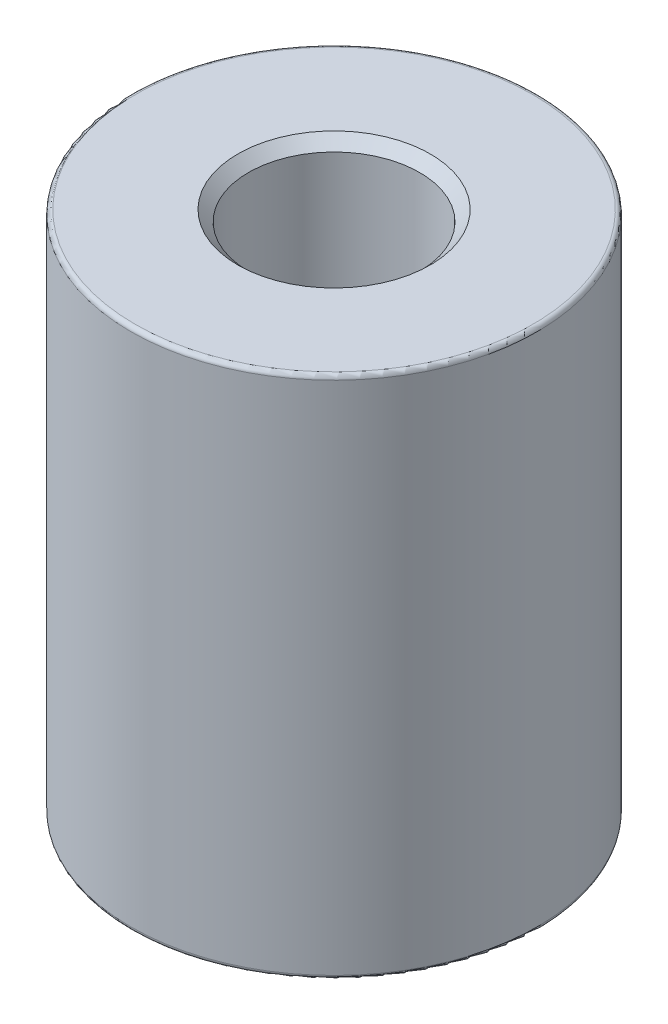
ISO-10303-21;
HEADER;
FILE_DESCRIPTION(('STEP AP214'),'2;1');
FILE_NAME('part.step','',(''),(''),'','','');
FILE_SCHEMA(('AUTOMOTIVE_DESIGN { 1 0 10303 214 1 1 1 1 }'));
ENDSEC;
DATA;
#1=APPLICATION_CONTEXT('core data for automotive mechanical design processes');
#2=APPLICATION_PROTOCOL_DEFINITION('international standard','automotive_design',2000,#1);
#3=PRODUCT_CONTEXT('',#1,'mechanical');
#4=PRODUCT('Part','Part','',(#3));
#5=PRODUCT_RELATED_PRODUCT_CATEGORY('part','',(#4));
#6=PRODUCT_DEFINITION_FORMATION('','',#4);
#7=PRODUCT_DEFINITION_CONTEXT('part definition',#1,'design');
#8=PRODUCT_DEFINITION('design','',#6,#7);
#9=PRODUCT_DEFINITION_SHAPE('','',#8);
#10=(LENGTH_UNIT() NAMED_UNIT(*) SI_UNIT(.MILLI.,.METRE.));
#11=(NAMED_UNIT(*) PLANE_ANGLE_UNIT() SI_UNIT($,.RADIAN.));
#12=(NAMED_UNIT(*) SI_UNIT($,.STERADIAN.) SOLID_ANGLE_UNIT());
#13=UNCERTAINTY_MEASURE_WITH_UNIT(LENGTH_MEASURE(1.E-05),#10,'distance_accuracy_value','');
#14=(GEOMETRIC_REPRESENTATION_CONTEXT(3) GLOBAL_UNCERTAINTY_ASSIGNED_CONTEXT((#13)) GLOBAL_UNIT_ASSIGNED_CONTEXT((#10,
#11,#12)) REPRESENTATION_CONTEXT('',''));
#15=CARTESIAN_POINT('',(0.,0.,0.));
#16=DIRECTION('',(0.,0.,1.));
#17=DIRECTION('',(1.,0.,0.));
#18=AXIS2_PLACEMENT_3D('',#15,#16,#17);
#19=CARTESIAN_POINT('',(0.,24.5,0.));
#20=DIRECTION('',(0.,-1.,0.));
#21=DIRECTION('',(0.,0.,-1.));
#22=AXIS2_PLACEMENT_3D('',#19,#20,#21);
#23=CYLINDRICAL_SURFACE('',#22,9.5);
#24=CARTESIAN_POINT('',(0.,24.3,0.));
#25=DIRECTION('',(0.,1.,0.));
#26=DIRECTION('',(0.,0.,1.));
#27=AXIS2_PLACEMENT_3D('',#24,#25,#26);
#28=CIRCLE('',#27,9.5);
#29=CARTESIAN_POINT('',(0.,24.3,9.5));
#30=VERTEX_POINT('',#29);
#31=EDGE_CURVE('E45',#30,#30,#28,.F.);
#32=ORIENTED_EDGE('',*,*,#31,.T.);
#33=EDGE_LOOP('',(#32));
#34=FACE_BOUND('',#33,.T.);
#35=CARTESIAN_POINT('',(0.,0.199999999999999,0.));
#36=DIRECTION('',(0.,1.,0.));
#37=DIRECTION('',(0.,0.,1.));
#38=AXIS2_PLACEMENT_3D('',#35,#36,#37);
#39=CIRCLE('',#38,9.5);
#40=CARTESIAN_POINT('',(0.,0.199999999999999,9.5));
#41=VERTEX_POINT('',#40);
#42=EDGE_CURVE('E50',#41,#41,#39,.T.);
#43=ORIENTED_EDGE('',*,*,#42,.T.);
#44=EDGE_LOOP('',(#43));
#45=FACE_BOUND('',#44,.T.);
#46=ADVANCED_FACE('F37',(#34,#45),#23,.T.);
#47=CARTESIAN_POINT('',(0.,24.5,0.));
#48=DIRECTION('',(0.,1.,0.));
#49=DIRECTION('',(0.,0.,1.));
#50=AXIS2_PLACEMENT_3D('',#47,#48,#49);
#51=PLANE('',#50);
#52=CARTESIAN_POINT('',(0.,24.5,0.));
#53=DIRECTION('',(0.,1.,0.));
#54=DIRECTION('',(0.,0.,1.));
#55=AXIS2_PLACEMENT_3D('',#52,#53,#54);
#56=CIRCLE('',#55,9.3);
#57=CARTESIAN_POINT('',(0.,24.5,9.3));
#58=VERTEX_POINT('',#57);
#59=EDGE_CURVE('E55',#58,#58,#56,.T.);
#60=ORIENTED_EDGE('',*,*,#59,.T.);
#61=EDGE_LOOP('',(#60));
#62=FACE_BOUND('',#61,.T.);
#63=CARTESIAN_POINT('',(0.,24.5,0.));
#64=DIRECTION('',(0.,1.,0.));
#65=DIRECTION('',(0.,0.,1.));
#66=AXIS2_PLACEMENT_3D('',#63,#64,#65);
#67=CIRCLE('',#66,4.50000000000001);
#68=CARTESIAN_POINT('',(0.,24.5,4.50000000000001));
#69=VERTEX_POINT('',#68);
#70=EDGE_CURVE('E69',#69,#69,#67,.F.);
#71=ORIENTED_EDGE('',*,*,#70,.T.);
#72=EDGE_LOOP('',(#71));
#73=FACE_BOUND('',#72,.T.);
#74=ADVANCED_FACE('F100',(#62,#73),#51,.T.);
#75=CARTESIAN_POINT('',(0.,0.,0.));
#76=DIRECTION('',(0.,1.,0.));
#77=DIRECTION('',(0.,0.,1.));
#78=AXIS2_PLACEMENT_3D('',#75,#76,#77);
#79=PLANE('',#78);
#80=CARTESIAN_POINT('',(0.,0.,0.));
#81=DIRECTION('',(0.,1.,0.));
#82=DIRECTION('',(0.,0.,1.));
#83=AXIS2_PLACEMENT_3D('',#80,#81,#82);
#84=CIRCLE('',#83,9.3);
#85=CARTESIAN_POINT('',(0.,0.,9.3));
#86=VERTEX_POINT('',#85);
#87=EDGE_CURVE('E10',#86,#86,#84,.F.);
#88=ORIENTED_EDGE('',*,*,#87,.T.);
#89=EDGE_LOOP('',(#88));
#90=FACE_BOUND('',#89,.T.);
#91=CARTESIAN_POINT('',(0.,0.,0.));
#92=DIRECTION('',(0.,1.,0.));
#93=DIRECTION('',(0.,0.,1.));
#94=AXIS2_PLACEMENT_3D('',#91,#92,#93);
#95=CIRCLE('',#94,3.5);
#96=CARTESIAN_POINT('',(0.,0.,3.5));
#97=VERTEX_POINT('',#96);
#98=EDGE_CURVE('E61',#97,#97,#95,.T.);
#99=ORIENTED_EDGE('',*,*,#98,.T.);
#100=EDGE_LOOP('',(#99));
#101=FACE_BOUND('',#100,.T.);
#102=ADVANCED_FACE('F90',(#90,#101),#79,.F.);
#103=CARTESIAN_POINT('',(0.,8.5,0.));
#104=DIRECTION('',(0.,1.,0.));
#105=DIRECTION('',(0.,0.,1.));
#106=AXIS2_PLACEMENT_3D('',#103,#104,#105);
#107=CYLINDRICAL_SURFACE('',#106,4.);
#108=CARTESIAN_POINT('',(0.,24.,0.));
#109=DIRECTION('',(0.,1.,0.));
#110=DIRECTION('',(0.,0.,1.));
#111=AXIS2_PLACEMENT_3D('',#108,#109,#110);
#112=CIRCLE('',#111,4.);
#113=CARTESIAN_POINT('',(0.,24.,4.));
#114=VERTEX_POINT('',#113);
#115=EDGE_CURVE('E73',#114,#114,#112,.T.);
#116=ORIENTED_EDGE('',*,*,#115,.T.);
#117=EDGE_LOOP('',(#116));
#118=FACE_BOUND('',#117,.T.);
#119=CARTESIAN_POINT('',(0.,8.5,0.));
#120=DIRECTION('',(0.,1.,0.));
#121=DIRECTION('',(0.,0.,1.));
#122=AXIS2_PLACEMENT_3D('',#119,#120,#121);
#123=CIRCLE('',#122,4.);
#124=CARTESIAN_POINT('',(0.,8.5,4.));
#125=VERTEX_POINT('',#124);
#126=EDGE_CURVE('E77',#125,#125,#123,.T.);
#127=ORIENTED_EDGE('',*,*,#126,.F.);
#128=EDGE_LOOP('',(#127));
#129=FACE_BOUND('',#128,.T.);
#130=ADVANCED_FACE('F88',(#118,#129),#107,.F.);
#131=CARTESIAN_POINT('',(0.,8.5,0.));
#132=DIRECTION('',(0.,1.,0.));
#133=DIRECTION('',(0.,0.,1.));
#134=AXIS2_PLACEMENT_3D('',#131,#132,#133);
#135=PLANE('',#134);
#136=CARTESIAN_POINT('',(0.,8.5,0.));
#137=DIRECTION('',(0.,1.,0.));
#138=DIRECTION('',(0.,0.,1.));
#139=AXIS2_PLACEMENT_3D('',#136,#137,#138);
#140=CIRCLE('',#139,3.);
#141=CARTESIAN_POINT('',(0.,8.5,3.));
#142=VERTEX_POINT('',#141);
#143=EDGE_CURVE('E78',#142,#142,#140,.T.);
#144=ORIENTED_EDGE('',*,*,#143,.F.);
#145=EDGE_LOOP('',(#144));
#146=FACE_BOUND('',#145,.T.);
#147=ORIENTED_EDGE('',*,*,#126,.T.);
#148=EDGE_LOOP('',(#147));
#149=FACE_BOUND('',#148,.T.);
#150=ADVANCED_FACE('F86',(#146,#149),#135,.T.);
#151=CARTESIAN_POINT('',(0.,16.,0.));
#152=DIRECTION('',(0.,-1.,0.));
#153=DIRECTION('',(0.,0.,-1.));
#154=AXIS2_PLACEMENT_3D('',#151,#152,#153);
#155=CYLINDRICAL_SURFACE('',#154,3.);
#156=CARTESIAN_POINT('',(0.,0.499999999999997,0.));
#157=DIRECTION('',(0.,1.,0.));
#158=DIRECTION('',(0.,0.,1.));
#159=AXIS2_PLACEMENT_3D('',#156,#157,#158);
#160=CIRCLE('',#159,3.);
#161=CARTESIAN_POINT('',(0.,0.499999999999997,3.));
#162=VERTEX_POINT('',#161);
#163=EDGE_CURVE('E65',#162,#162,#160,.F.);
#164=ORIENTED_EDGE('',*,*,#163,.T.);
#165=EDGE_LOOP('',(#164));
#166=FACE_BOUND('',#165,.T.);
#167=ORIENTED_EDGE('',*,*,#143,.T.);
#168=EDGE_LOOP('',(#167));
#169=FACE_BOUND('',#168,.T.);
#170=ADVANCED_FACE('F97',(#166,#169),#155,.F.);
#171=CARTESIAN_POINT('',(0.,24.,0.));
#172=DIRECTION('',(0.,1.,0.));
#173=DIRECTION('',(0.,0.,1.));
#174=AXIS2_PLACEMENT_3D('',#171,#172,#173);
#175=CONICAL_SURFACE('',#174,4.,0.785398163397459);
#176=ORIENTED_EDGE('',*,*,#70,.F.);
#177=EDGE_LOOP('',(#176));
#178=FACE_BOUND('',#177,.T.);
#179=ORIENTED_EDGE('',*,*,#115,.F.);
#180=EDGE_LOOP('',(#179));
#181=FACE_BOUND('',#180,.T.);
#182=ADVANCED_FACE('F111',(#178,#181),#175,.F.);
#183=CARTESIAN_POINT('',(0.,0.499999999999997,0.));
#184=DIRECTION('',(0.,-1.,0.));
#185=DIRECTION('',(0.,0.,-1.));
#186=AXIS2_PLACEMENT_3D('',#183,#184,#185);
#187=CONICAL_SURFACE('',#186,3.,0.785398163397451);
#188=ORIENTED_EDGE('',*,*,#98,.F.);
#189=EDGE_LOOP('',(#188));
#190=FACE_BOUND('',#189,.T.);
#191=ORIENTED_EDGE('',*,*,#163,.F.);
#192=EDGE_LOOP('',(#191));
#193=FACE_BOUND('',#192,.T.);
#194=ADVANCED_FACE('F114',(#190,#193),#187,.F.);
#195=CARTESIAN_POINT('',(0.,24.3,0.));
#196=DIRECTION('',(0.,1.,0.));
#197=DIRECTION('',(0.,0.,1.));
#198=AXIS2_PLACEMENT_3D('',#195,#196,#197);
#199=TOROIDAL_SURFACE('',#198,9.3,0.2);
#200=ORIENTED_EDGE('',*,*,#31,.F.);
#201=EDGE_LOOP('',(#200));
#202=FACE_BOUND('',#201,.T.);
#203=ORIENTED_EDGE('',*,*,#59,.F.);
#204=EDGE_LOOP('',(#203));
#205=FACE_BOUND('',#204,.T.);
#206=ADVANCED_FACE('F117',(#202,#205),#199,.T.);
#207=CARTESIAN_POINT('',(0.,0.199999999999999,0.));
#208=DIRECTION('',(0.,1.,0.));
#209=DIRECTION('',(0.,0.,1.));
#210=AXIS2_PLACEMENT_3D('',#207,#208,#209);
#211=TOROIDAL_SURFACE('',#210,9.3,0.2);
#212=ORIENTED_EDGE('',*,*,#87,.F.);
#213=EDGE_LOOP('',(#212));
#214=FACE_BOUND('',#213,.T.);
#215=ORIENTED_EDGE('',*,*,#42,.F.);
#216=EDGE_LOOP('',(#215));
#217=FACE_BOUND('',#216,.T.);
#218=ADVANCED_FACE('F39',(#214,#217),#211,.T.);
#219=CLOSED_SHELL('',(#46,#74,#102,#130,#150,#170,#182,#194,#206,#218));
#220=MANIFOLD_SOLID_BREP('B2',#219);
#221=ADVANCED_BREP_SHAPE_REPRESENTATION('',(#18,#220),#14);
#222=SHAPE_DEFINITION_REPRESENTATION(#9,#221);
ENDSEC;
END-ISO-10303-21;
